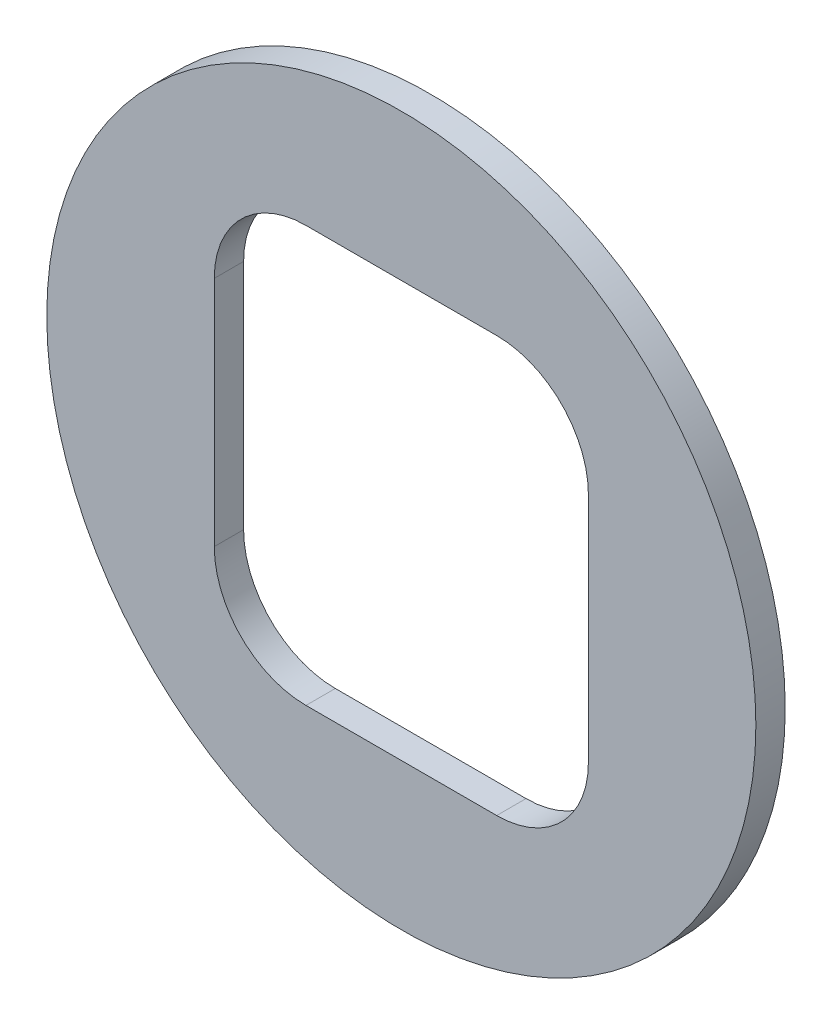
ISO-10303-21;
HEADER;
FILE_DESCRIPTION(('STEP AP214'),'2;1');
FILE_NAME('part.step','',(''),(''),'','','');
FILE_SCHEMA(('AUTOMOTIVE_DESIGN { 1 0 10303 214 1 1 1 1 }'));
ENDSEC;
DATA;
#1=APPLICATION_CONTEXT('core data for automotive mechanical design processes');
#2=APPLICATION_PROTOCOL_DEFINITION('international standard','automotive_design',2000,#1);
#3=PRODUCT_CONTEXT('',#1,'mechanical');
#4=PRODUCT('Part','Part','',(#3));
#5=PRODUCT_RELATED_PRODUCT_CATEGORY('part','',(#4));
#6=PRODUCT_DEFINITION_FORMATION('','',#4);
#7=PRODUCT_DEFINITION_CONTEXT('part definition',#1,'design');
#8=PRODUCT_DEFINITION('design','',#6,#7);
#9=PRODUCT_DEFINITION_SHAPE('','',#8);
#10=(LENGTH_UNIT() NAMED_UNIT(*) SI_UNIT(.MILLI.,.METRE.));
#11=(NAMED_UNIT(*) PLANE_ANGLE_UNIT() SI_UNIT($,.RADIAN.));
#12=(NAMED_UNIT(*) SI_UNIT($,.STERADIAN.) SOLID_ANGLE_UNIT());
#13=UNCERTAINTY_MEASURE_WITH_UNIT(LENGTH_MEASURE(1.E-05),#10,'distance_accuracy_value','');
#14=(GEOMETRIC_REPRESENTATION_CONTEXT(3) GLOBAL_UNCERTAINTY_ASSIGNED_CONTEXT((#13)) GLOBAL_UNIT_ASSIGNED_CONTEXT((#10,
#11,#12)) REPRESENTATION_CONTEXT('',''));
#15=CARTESIAN_POINT('',(0.,0.,0.));
#16=DIRECTION('',(0.,0.,1.));
#17=DIRECTION('',(1.,0.,0.));
#18=AXIS2_PLACEMENT_3D('',#15,#16,#17);
#19=CARTESIAN_POINT('',(0.,0.,1.524));
#20=DIRECTION('',(0.,0.,1.));
#21=DIRECTION('',(1.,0.,0.));
#22=AXIS2_PLACEMENT_3D('',#19,#20,#21);
#23=PLANE('',#22);
#24=CARTESIAN_POINT('',(0.,0.,1.524));
#25=DIRECTION('',(0.,0.,1.));
#26=DIRECTION('',(1.,0.,0.));
#27=AXIS2_PLACEMENT_3D('',#24,#25,#26);
#28=CIRCLE('',#27,18.415);
#29=CARTESIAN_POINT('',(18.415,0.,1.524));
#30=VERTEX_POINT('',#29);
#31=EDGE_CURVE('E115',#30,#30,#28,.T.);
#32=ORIENTED_EDGE('',*,*,#31,.T.);
#33=EDGE_LOOP('',(#32));
#34=FACE_BOUND('',#33,.T.);
#35=DIRECTION('',(1.,0.,0.));
#36=VECTOR('',#35,1.);
#37=CARTESIAN_POINT('',(-9.7155,-10.795,1.524));
#38=LINE('',#37,#36);
#39=CARTESIAN_POINT('',(-4.953,-10.795,1.524));
#40=VERTEX_POINT('',#39);
#41=CARTESIAN_POINT('',(4.953,-10.795,1.524));
#42=VERTEX_POINT('',#41);
#43=EDGE_CURVE('E160',#40,#42,#38,.T.);
#44=ORIENTED_EDGE('',*,*,#43,.F.);
#45=CARTESIAN_POINT('',(-4.953,-6.0325,1.524));
#46=DIRECTION('',(0.,0.,1.));
#47=DIRECTION('',(1.,0.,0.));
#48=AXIS2_PLACEMENT_3D('',#45,#46,#47);
#49=CIRCLE('',#48,4.7625);
#50=CARTESIAN_POINT('',(-9.7155,-6.0325,1.524));
#51=VERTEX_POINT('',#50);
#52=EDGE_CURVE('E138',#40,#51,#49,.F.);
#53=ORIENTED_EDGE('',*,*,#52,.T.);
#54=DIRECTION('',(0.,-1.,0.));
#55=VECTOR('',#54,1.);
#56=CARTESIAN_POINT('',(-9.7155,10.795,1.524));
#57=LINE('',#56,#55);
#58=CARTESIAN_POINT('',(-9.7155,6.0325,1.524));
#59=VERTEX_POINT('',#58);
#60=EDGE_CURVE('E165',#59,#51,#57,.T.);
#61=ORIENTED_EDGE('',*,*,#60,.F.);
#62=CARTESIAN_POINT('',(-4.953,6.0325,1.524));
#63=DIRECTION('',(0.,0.,1.));
#64=DIRECTION('',(1.,0.,0.));
#65=AXIS2_PLACEMENT_3D('',#62,#63,#64);
#66=CIRCLE('',#65,4.7625);
#67=CARTESIAN_POINT('',(-4.953,10.795,1.524));
#68=VERTEX_POINT('',#67);
#69=EDGE_CURVE('E11',#59,#68,#66,.F.);
#70=ORIENTED_EDGE('',*,*,#69,.T.);
#71=DIRECTION('',(-1.,0.,0.));
#72=VECTOR('',#71,1.);
#73=CARTESIAN_POINT('',(-9.7155,10.795,1.524));
#74=LINE('',#73,#72);
#75=CARTESIAN_POINT('',(4.953,10.795,1.524));
#76=VERTEX_POINT('',#75);
#77=EDGE_CURVE('E152',#76,#68,#74,.T.);
#78=ORIENTED_EDGE('',*,*,#77,.F.);
#79=CARTESIAN_POINT('',(4.953,6.0325,1.524));
#80=DIRECTION('',(0.,0.,1.));
#81=DIRECTION('',(1.,0.,0.));
#82=AXIS2_PLACEMENT_3D('',#79,#80,#81);
#83=CIRCLE('',#82,4.7625);
#84=CARTESIAN_POINT('',(9.7155,6.0325,1.524));
#85=VERTEX_POINT('',#84);
#86=EDGE_CURVE('E105',#76,#85,#83,.F.);
#87=ORIENTED_EDGE('',*,*,#86,.T.);
#88=DIRECTION('',(0.,1.,0.));
#89=VECTOR('',#88,1.);
#90=CARTESIAN_POINT('',(9.7155,10.795,1.524));
#91=LINE('',#90,#89);
#92=CARTESIAN_POINT('',(9.7155,-6.0325,1.524));
#93=VERTEX_POINT('',#92);
#94=EDGE_CURVE('E150',#93,#85,#91,.T.);
#95=ORIENTED_EDGE('',*,*,#94,.F.);
#96=CARTESIAN_POINT('',(4.953,-6.0325,1.524));
#97=DIRECTION('',(0.,0.,1.));
#98=DIRECTION('',(1.,0.,0.));
#99=AXIS2_PLACEMENT_3D('',#96,#97,#98);
#100=CIRCLE('',#99,4.7625);
#101=EDGE_CURVE('E142',#93,#42,#100,.F.);
#102=ORIENTED_EDGE('',*,*,#101,.T.);
#103=EDGE_LOOP('',(#44,#53,#61,#70,#78,#87,#95,#102));
#104=FACE_BOUND('',#103,.T.);
#105=ADVANCED_FACE('F32',(#34,#104),#23,.T.);
#106=CARTESIAN_POINT('',(0.,0.,0.));
#107=DIRECTION('',(0.,0.,1.));
#108=DIRECTION('',(1.,0.,0.));
#109=AXIS2_PLACEMENT_3D('',#106,#107,#108);
#110=PLANE('',#109);
#111=CARTESIAN_POINT('',(0.,0.,0.));
#112=DIRECTION('',(0.,0.,1.));
#113=DIRECTION('',(1.,0.,0.));
#114=AXIS2_PLACEMENT_3D('',#111,#112,#113);
#115=CIRCLE('',#114,18.415);
#116=CARTESIAN_POINT('',(18.415,0.,0.));
#117=VERTEX_POINT('',#116);
#118=EDGE_CURVE('E120',#117,#117,#115,.T.);
#119=ORIENTED_EDGE('',*,*,#118,.F.);
#120=EDGE_LOOP('',(#119));
#121=FACE_BOUND('',#120,.T.);
#122=DIRECTION('',(-1.,0.,0.));
#123=VECTOR('',#122,1.);
#124=CARTESIAN_POINT('',(-9.7155,10.795,0.));
#125=LINE('',#124,#123);
#126=CARTESIAN_POINT('',(4.953,10.795,0.));
#127=VERTEX_POINT('',#126);
#128=CARTESIAN_POINT('',(-4.953,10.795,0.));
#129=VERTEX_POINT('',#128);
#130=EDGE_CURVE('E100',#127,#129,#125,.T.);
#131=ORIENTED_EDGE('',*,*,#130,.T.);
#132=CARTESIAN_POINT('',(-4.953,6.0325,0.));
#133=DIRECTION('',(0.,0.,1.));
#134=DIRECTION('',(1.,0.,0.));
#135=AXIS2_PLACEMENT_3D('',#132,#133,#134);
#136=CIRCLE('',#135,4.7625);
#137=CARTESIAN_POINT('',(-9.7155,6.0325,0.));
#138=VERTEX_POINT('',#137);
#139=EDGE_CURVE('E40',#129,#138,#136,.T.);
#140=ORIENTED_EDGE('',*,*,#139,.T.);
#141=DIRECTION('',(0.,-1.,0.));
#142=VECTOR('',#141,1.);
#143=CARTESIAN_POINT('',(-9.7155,10.795,0.));
#144=LINE('',#143,#142);
#145=CARTESIAN_POINT('',(-9.7155,-6.0325,0.));
#146=VERTEX_POINT('',#145);
#147=EDGE_CURVE('E99',#138,#146,#144,.T.);
#148=ORIENTED_EDGE('',*,*,#147,.T.);
#149=CARTESIAN_POINT('',(-4.953,-6.0325,0.));
#150=DIRECTION('',(0.,0.,1.));
#151=DIRECTION('',(1.,0.,0.));
#152=AXIS2_PLACEMENT_3D('',#149,#150,#151);
#153=CIRCLE('',#152,4.7625);
#154=CARTESIAN_POINT('',(-4.953,-10.795,0.));
#155=VERTEX_POINT('',#154);
#156=EDGE_CURVE('E136',#146,#155,#153,.T.);
#157=ORIENTED_EDGE('',*,*,#156,.T.);
#158=DIRECTION('',(1.,0.,0.));
#159=VECTOR('',#158,1.);
#160=CARTESIAN_POINT('',(-9.7155,-10.795,0.));
#161=LINE('',#160,#159);
#162=CARTESIAN_POINT('',(4.953,-10.795,0.));
#163=VERTEX_POINT('',#162);
#164=EDGE_CURVE('E113',#155,#163,#161,.T.);
#165=ORIENTED_EDGE('',*,*,#164,.T.);
#166=CARTESIAN_POINT('',(4.953,-6.0325,0.));
#167=DIRECTION('',(0.,0.,1.));
#168=DIRECTION('',(1.,0.,0.));
#169=AXIS2_PLACEMENT_3D('',#166,#167,#168);
#170=CIRCLE('',#169,4.7625);
#171=CARTESIAN_POINT('',(9.7155,-6.0325,0.));
#172=VERTEX_POINT('',#171);
#173=EDGE_CURVE('E140',#163,#172,#170,.T.);
#174=ORIENTED_EDGE('',*,*,#173,.T.);
#175=DIRECTION('',(0.,1.,0.));
#176=VECTOR('',#175,1.);
#177=CARTESIAN_POINT('',(9.7155,10.795,0.));
#178=LINE('',#177,#176);
#179=CARTESIAN_POINT('',(9.7155,6.0325,0.));
#180=VERTEX_POINT('',#179);
#181=EDGE_CURVE('E163',#172,#180,#178,.T.);
#182=ORIENTED_EDGE('',*,*,#181,.T.);
#183=CARTESIAN_POINT('',(4.953,6.0325,0.));
#184=DIRECTION('',(0.,0.,1.));
#185=DIRECTION('',(1.,0.,0.));
#186=AXIS2_PLACEMENT_3D('',#183,#184,#185);
#187=CIRCLE('',#186,4.7625);
#188=EDGE_CURVE('E144',#180,#127,#187,.T.);
#189=ORIENTED_EDGE('',*,*,#188,.T.);
#190=EDGE_LOOP('',(#131,#140,#148,#157,#165,#174,#182,#189));
#191=FACE_BOUND('',#190,.T.);
#192=ADVANCED_FACE('F98',(#121,#191),#110,.F.);
#193=CARTESIAN_POINT('',(0.,0.,1.524));
#194=DIRECTION('',(0.,0.,-1.));
#195=DIRECTION('',(-1.,0.,0.));
#196=AXIS2_PLACEMENT_3D('',#193,#194,#195);
#197=CYLINDRICAL_SURFACE('',#196,18.415);
#198=ORIENTED_EDGE('',*,*,#31,.F.);
#199=EDGE_LOOP('',(#198));
#200=FACE_BOUND('',#199,.T.);
#201=ORIENTED_EDGE('',*,*,#118,.T.);
#202=EDGE_LOOP('',(#201));
#203=FACE_BOUND('',#202,.T.);
#204=ADVANCED_FACE('F199',(#200,#203),#197,.T.);
#205=CARTESIAN_POINT('',(-9.7155,10.795,1.524));
#206=DIRECTION('',(1.,0.,0.));
#207=DIRECTION('',(0.,1.,0.));
#208=AXIS2_PLACEMENT_3D('',#205,#206,#207);
#209=PLANE('',#208);
#210=ORIENTED_EDGE('',*,*,#60,.T.);
#211=DIRECTION('',(0.,0.,-1.));
#212=VECTOR('',#211,1.);
#213=CARTESIAN_POINT('',(-9.7155,-6.0325,0.));
#214=LINE('',#213,#212);
#215=EDGE_CURVE('E112',#51,#146,#214,.T.);
#216=ORIENTED_EDGE('',*,*,#215,.T.);
#217=ORIENTED_EDGE('',*,*,#147,.F.);
#218=DIRECTION('',(0.,0.,-1.));
#219=VECTOR('',#218,1.);
#220=CARTESIAN_POINT('',(-9.7155,6.0325,1.524));
#221=LINE('',#220,#219);
#222=EDGE_CURVE('E110',#138,#59,#221,.F.);
#223=ORIENTED_EDGE('',*,*,#222,.T.);
#224=EDGE_LOOP('',(#210,#216,#217,#223));
#225=FACE_BOUND('',#224,.T.);
#226=ADVANCED_FACE('F109',(#225),#209,.T.);
#227=CARTESIAN_POINT('',(-9.7155,-10.795,1.524));
#228=DIRECTION('',(0.,1.,0.));
#229=DIRECTION('',(0.,0.,1.));
#230=AXIS2_PLACEMENT_3D('',#227,#228,#229);
#231=PLANE('',#230);
#232=ORIENTED_EDGE('',*,*,#164,.F.);
#233=DIRECTION('',(0.,0.,-1.));
#234=VECTOR('',#233,1.);
#235=CARTESIAN_POINT('',(-4.953,-10.795,1.524));
#236=LINE('',#235,#234);
#237=EDGE_CURVE('E126',#155,#40,#236,.F.);
#238=ORIENTED_EDGE('',*,*,#237,.T.);
#239=ORIENTED_EDGE('',*,*,#43,.T.);
#240=DIRECTION('',(0.,0.,-1.));
#241=VECTOR('',#240,1.);
#242=CARTESIAN_POINT('',(4.953,-10.795,0.));
#243=LINE('',#242,#241);
#244=EDGE_CURVE('E117',#42,#163,#243,.T.);
#245=ORIENTED_EDGE('',*,*,#244,.T.);
#246=EDGE_LOOP('',(#232,#238,#239,#245));
#247=FACE_BOUND('',#246,.T.);
#248=ADVANCED_FACE('F177',(#247),#231,.T.);
#249=CARTESIAN_POINT('',(9.7155,10.795,1.524));
#250=DIRECTION('',(-1.,0.,0.));
#251=DIRECTION('',(0.,-1.,0.));
#252=AXIS2_PLACEMENT_3D('',#249,#250,#251);
#253=PLANE('',#252);
#254=ORIENTED_EDGE('',*,*,#181,.F.);
#255=DIRECTION('',(0.,0.,-1.));
#256=VECTOR('',#255,1.);
#257=CARTESIAN_POINT('',(9.7155,-6.0325,1.524));
#258=LINE('',#257,#256);
#259=EDGE_CURVE('E131',#172,#93,#258,.F.);
#260=ORIENTED_EDGE('',*,*,#259,.T.);
#261=ORIENTED_EDGE('',*,*,#94,.T.);
#262=DIRECTION('',(0.,0.,-1.));
#263=VECTOR('',#262,1.);
#264=CARTESIAN_POINT('',(9.7155,6.0325,0.));
#265=LINE('',#264,#263);
#266=EDGE_CURVE('E128',#85,#180,#265,.T.);
#267=ORIENTED_EDGE('',*,*,#266,.T.);
#268=EDGE_LOOP('',(#254,#260,#261,#267));
#269=FACE_BOUND('',#268,.T.);
#270=ADVANCED_FACE('F157',(#269),#253,.T.);
#271=CARTESIAN_POINT('',(-9.7155,10.795,1.524));
#272=DIRECTION('',(0.,-1.,0.));
#273=DIRECTION('',(0.,0.,-1.));
#274=AXIS2_PLACEMENT_3D('',#271,#272,#273);
#275=PLANE('',#274);
#276=ORIENTED_EDGE('',*,*,#130,.F.);
#277=DIRECTION('',(0.,0.,-1.));
#278=VECTOR('',#277,1.);
#279=CARTESIAN_POINT('',(4.953,10.795,1.524));
#280=LINE('',#279,#278);
#281=EDGE_CURVE('E52',#127,#76,#280,.F.);
#282=ORIENTED_EDGE('',*,*,#281,.T.);
#283=ORIENTED_EDGE('',*,*,#77,.T.);
#284=DIRECTION('',(0.,0.,-1.));
#285=VECTOR('',#284,1.);
#286=CARTESIAN_POINT('',(-4.953,10.795,0.));
#287=LINE('',#286,#285);
#288=EDGE_CURVE('E133',#68,#129,#287,.T.);
#289=ORIENTED_EDGE('',*,*,#288,.T.);
#290=EDGE_LOOP('',(#276,#282,#283,#289));
#291=FACE_BOUND('',#290,.T.);
#292=ADVANCED_FACE('F164',(#291),#275,.T.);
#293=CARTESIAN_POINT('',(-4.953,-6.0325,1.524));
#294=DIRECTION('',(0.,0.,1.));
#295=DIRECTION('',(1.,0.,0.));
#296=AXIS2_PLACEMENT_3D('',#293,#294,#295);
#297=CYLINDRICAL_SURFACE('',#296,4.7625);
#298=ORIENTED_EDGE('',*,*,#52,.F.);
#299=ORIENTED_EDGE('',*,*,#237,.F.);
#300=ORIENTED_EDGE('',*,*,#156,.F.);
#301=ORIENTED_EDGE('',*,*,#215,.F.);
#302=EDGE_LOOP('',(#298,#299,#300,#301));
#303=FACE_BOUND('',#302,.T.);
#304=ADVANCED_FACE('F183',(#303),#297,.F.);
#305=CARTESIAN_POINT('',(4.953,-6.0325,1.524));
#306=DIRECTION('',(0.,0.,1.));
#307=DIRECTION('',(1.,0.,0.));
#308=AXIS2_PLACEMENT_3D('',#305,#306,#307);
#309=CYLINDRICAL_SURFACE('',#308,4.7625);
#310=ORIENTED_EDGE('',*,*,#101,.F.);
#311=ORIENTED_EDGE('',*,*,#259,.F.);
#312=ORIENTED_EDGE('',*,*,#173,.F.);
#313=ORIENTED_EDGE('',*,*,#244,.F.);
#314=EDGE_LOOP('',(#310,#311,#312,#313));
#315=FACE_BOUND('',#314,.T.);
#316=ADVANCED_FACE('F181',(#315),#309,.F.);
#317=CARTESIAN_POINT('',(4.953,6.0325,1.524));
#318=DIRECTION('',(0.,0.,1.));
#319=DIRECTION('',(1.,0.,0.));
#320=AXIS2_PLACEMENT_3D('',#317,#318,#319);
#321=CYLINDRICAL_SURFACE('',#320,4.7625);
#322=ORIENTED_EDGE('',*,*,#86,.F.);
#323=ORIENTED_EDGE('',*,*,#281,.F.);
#324=ORIENTED_EDGE('',*,*,#188,.F.);
#325=ORIENTED_EDGE('',*,*,#266,.F.);
#326=EDGE_LOOP('',(#322,#323,#324,#325));
#327=FACE_BOUND('',#326,.T.);
#328=ADVANCED_FACE('F162',(#327),#321,.F.);
#329=CARTESIAN_POINT('',(-4.953,6.0325,1.524));
#330=DIRECTION('',(0.,0.,1.));
#331=DIRECTION('',(1.,0.,0.));
#332=AXIS2_PLACEMENT_3D('',#329,#330,#331);
#333=CYLINDRICAL_SURFACE('',#332,4.7625);
#334=ORIENTED_EDGE('',*,*,#69,.F.);
#335=ORIENTED_EDGE('',*,*,#222,.F.);
#336=ORIENTED_EDGE('',*,*,#139,.F.);
#337=ORIENTED_EDGE('',*,*,#288,.F.);
#338=EDGE_LOOP('',(#334,#335,#336,#337));
#339=FACE_BOUND('',#338,.T.);
#340=ADVANCED_FACE('F34',(#339),#333,.F.);
#341=CLOSED_SHELL('',(#105,#192,#204,#226,#248,#270,#292,#304,#316,#328,#340));
#342=MANIFOLD_SOLID_BREP('B2',#341);
#343=ADVANCED_BREP_SHAPE_REPRESENTATION('',(#18,#342),#14);
#344=SHAPE_DEFINITION_REPRESENTATION(#9,#343);
ENDSEC;
END-ISO-10303-21;
